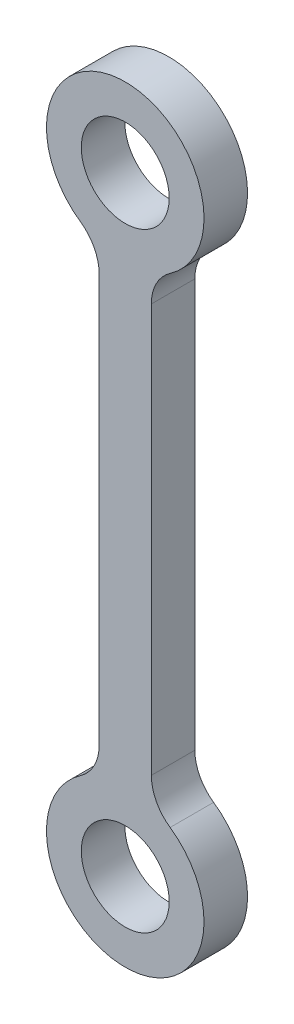
ISO-10303-21;
HEADER;
FILE_DESCRIPTION(('STEP AP214'),'2;1');
FILE_NAME('part.step','',(''),(''),'','','');
FILE_SCHEMA(('AUTOMOTIVE_DESIGN { 1 0 10303 214 1 1 1 1 }'));
ENDSEC;
DATA;
#1=APPLICATION_CONTEXT('core data for automotive mechanical design processes');
#2=APPLICATION_PROTOCOL_DEFINITION('international standard','automotive_design',2000,#1);
#3=PRODUCT_CONTEXT('',#1,'mechanical');
#4=PRODUCT('Part','Part','',(#3));
#5=PRODUCT_RELATED_PRODUCT_CATEGORY('part','',(#4));
#6=PRODUCT_DEFINITION_FORMATION('','',#4);
#7=PRODUCT_DEFINITION_CONTEXT('part definition',#1,'design');
#8=PRODUCT_DEFINITION('design','',#6,#7);
#9=PRODUCT_DEFINITION_SHAPE('','',#8);
#10=(LENGTH_UNIT() NAMED_UNIT(*) SI_UNIT(.MILLI.,.METRE.));
#11=(NAMED_UNIT(*) PLANE_ANGLE_UNIT() SI_UNIT($,.RADIAN.));
#12=(NAMED_UNIT(*) SI_UNIT($,.STERADIAN.) SOLID_ANGLE_UNIT());
#13=UNCERTAINTY_MEASURE_WITH_UNIT(LENGTH_MEASURE(1.E-05),#10,'distance_accuracy_value','');
#14=(GEOMETRIC_REPRESENTATION_CONTEXT(3) GLOBAL_UNCERTAINTY_ASSIGNED_CONTEXT((#13)) GLOBAL_UNIT_ASSIGNED_CONTEXT((#10,
#11,#12)) REPRESENTATION_CONTEXT('',''));
#15=CARTESIAN_POINT('',(0.,0.,0.));
#16=DIRECTION('',(0.,0.,1.));
#17=DIRECTION('',(1.,0.,0.));
#18=AXIS2_PLACEMENT_3D('',#15,#16,#17);
#19=CARTESIAN_POINT('',(10.16,-74.2315,6.35));
#20=DIRECTION('',(0.,0.,1.));
#21=DIRECTION('',(1.,0.,0.));
#22=AXIS2_PLACEMENT_3D('',#19,#20,#21);
#23=PLANE('',#22);
#24=CARTESIAN_POINT('',(0.,0.,6.35));
#25=DIRECTION('',(0.,0.,1.));
#26=DIRECTION('',(1.,0.,0.));
#27=AXIS2_PLACEMENT_3D('',#24,#25,#26);
#28=CIRCLE('',#27,6.4135);
#29=CARTESIAN_POINT('',(6.4135,0.,6.35));
#30=VERTEX_POINT('',#29);
#31=EDGE_CURVE('E150',#30,#30,#28,.T.);
#32=ORIENTED_EDGE('',*,*,#31,.F.);
#33=EDGE_LOOP('',(#32));
#34=FACE_BOUND('',#33,.T.);
#35=CARTESIAN_POINT('',(10.16,-74.2315,6.35));
#36=DIRECTION('',(0.,0.,-1.));
#37=DIRECTION('',(1.,0.,0.));
#38=AXIS2_PLACEMENT_3D('',#35,#36,#37);
#39=CIRCLE('',#38,6.35);
#40=CARTESIAN_POINT('',(6.54434163701069,-79.4516067615658,6.35));
#41=VERTEX_POINT('',#40);
#42=CARTESIAN_POINT('',(3.81000000000001,-74.2315,6.35));
#43=VERTEX_POINT('',#42);
#44=EDGE_CURVE('E168',#41,#43,#39,.T.);
#45=ORIENTED_EDGE('',*,*,#44,.T.);
#46=DIRECTION('',(0.,1.,0.));
#47=VECTOR('',#46,1.);
#48=CARTESIAN_POINT('',(3.81,-14.6685,6.35));
#49=LINE('',#48,#47);
#50=CARTESIAN_POINT('',(3.81,-14.6685,6.35));
#51=VERTEX_POINT('',#50);
#52=EDGE_CURVE('E104',#43,#51,#49,.T.);
#53=ORIENTED_EDGE('',*,*,#52,.T.);
#54=CARTESIAN_POINT('',(10.16,-14.6685,6.35));
#55=DIRECTION('',(0.,0.,-1.));
#56=DIRECTION('',(-1.,0.,0.));
#57=AXIS2_PLACEMENT_3D('',#54,#55,#56);
#58=CIRCLE('',#57,6.35);
#59=CARTESIAN_POINT('',(6.54434163701068,-9.44839323843416,6.35));
#60=VERTEX_POINT('',#59);
#61=EDGE_CURVE('E189',#51,#60,#58,.T.);
#62=ORIENTED_EDGE('',*,*,#61,.T.);
#63=CARTESIAN_POINT('',(0.,0.,6.35));
#64=DIRECTION('',(0.,0.,1.));
#65=DIRECTION('',(1.,0.,0.));
#66=AXIS2_PLACEMENT_3D('',#63,#64,#65);
#67=CIRCLE('',#66,11.4935);
#68=CARTESIAN_POINT('',(-6.54434163701068,-9.44839323843416,6.35));
#69=VERTEX_POINT('',#68);
#70=EDGE_CURVE('E203',#60,#69,#67,.T.);
#71=ORIENTED_EDGE('',*,*,#70,.T.);
#72=CARTESIAN_POINT('',(-10.16,-14.6685,6.35));
#73=DIRECTION('',(0.,0.,-1.));
#74=DIRECTION('',(1.,0.,0.));
#75=AXIS2_PLACEMENT_3D('',#72,#73,#74);
#76=CIRCLE('',#75,6.35);
#77=CARTESIAN_POINT('',(-3.81,-14.6685,6.35));
#78=VERTEX_POINT('',#77);
#79=EDGE_CURVE('E123',#69,#78,#76,.T.);
#80=ORIENTED_EDGE('',*,*,#79,.T.);
#81=DIRECTION('',(0.,-1.,0.));
#82=VECTOR('',#81,1.);
#83=CARTESIAN_POINT('',(-3.81,-14.6685,6.35));
#84=LINE('',#83,#82);
#85=CARTESIAN_POINT('',(-3.80999999999999,-74.2315,6.35));
#86=VERTEX_POINT('',#85);
#87=EDGE_CURVE('E117',#78,#86,#84,.T.);
#88=ORIENTED_EDGE('',*,*,#87,.T.);
#89=CARTESIAN_POINT('',(-10.16,-74.2315,6.35));
#90=DIRECTION('',(0.,0.,-1.));
#91=DIRECTION('',(-1.,0.,0.));
#92=AXIS2_PLACEMENT_3D('',#89,#90,#91);
#93=CIRCLE('',#92,6.35);
#94=CARTESIAN_POINT('',(-6.54434163701067,-79.4516067615658,6.35));
#95=VERTEX_POINT('',#94);
#96=EDGE_CURVE('E121',#86,#95,#93,.T.);
#97=ORIENTED_EDGE('',*,*,#96,.T.);
#98=CARTESIAN_POINT('',(0.,-88.9,6.35));
#99=DIRECTION('',(0.,0.,1.));
#100=DIRECTION('',(1.,0.,0.));
#101=AXIS2_PLACEMENT_3D('',#98,#99,#100);
#102=CIRCLE('',#101,11.4935);
#103=EDGE_CURVE('E61',#95,#41,#102,.T.);
#104=ORIENTED_EDGE('',*,*,#103,.T.);
#105=EDGE_LOOP('',(#45,#53,#62,#71,#80,#88,#97,#104));
#106=FACE_BOUND('',#105,.T.);
#107=CARTESIAN_POINT('',(0.,-88.9,6.35));
#108=DIRECTION('',(0.,0.,1.));
#109=DIRECTION('',(1.,0.,0.));
#110=AXIS2_PLACEMENT_3D('',#107,#108,#109);
#111=CIRCLE('',#110,6.4135);
#112=CARTESIAN_POINT('',(6.41350000000001,-88.9,6.35));
#113=VERTEX_POINT('',#112);
#114=EDGE_CURVE('E217',#113,#113,#111,.T.);
#115=ORIENTED_EDGE('',*,*,#114,.F.);
#116=EDGE_LOOP('',(#115));
#117=FACE_BOUND('',#116,.T.);
#118=ADVANCED_FACE('F43',(#34,#106,#117),#23,.T.);
#119=CARTESIAN_POINT('',(10.16,-74.2315,0.));
#120=DIRECTION('',(0.,0.,1.));
#121=DIRECTION('',(1.,0.,0.));
#122=AXIS2_PLACEMENT_3D('',#119,#120,#121);
#123=PLANE('',#122);
#124=CARTESIAN_POINT('',(10.16,-74.2315,0.));
#125=DIRECTION('',(0.,0.,-1.));
#126=DIRECTION('',(1.,0.,0.));
#127=AXIS2_PLACEMENT_3D('',#124,#125,#126);
#128=CIRCLE('',#127,6.35);
#129=CARTESIAN_POINT('',(6.54434163701069,-79.4516067615658,0.));
#130=VERTEX_POINT('',#129);
#131=CARTESIAN_POINT('',(3.81000000000001,-74.2315,0.));
#132=VERTEX_POINT('',#131);
#133=EDGE_CURVE('E145',#130,#132,#128,.T.);
#134=ORIENTED_EDGE('',*,*,#133,.F.);
#135=CARTESIAN_POINT('',(0.,-88.9,0.));
#136=DIRECTION('',(0.,0.,1.));
#137=DIRECTION('',(1.,0.,0.));
#138=AXIS2_PLACEMENT_3D('',#135,#136,#137);
#139=CIRCLE('',#138,11.4935);
#140=CARTESIAN_POINT('',(-6.54434163701067,-79.4516067615658,0.));
#141=VERTEX_POINT('',#140);
#142=EDGE_CURVE('E96',#141,#130,#139,.T.);
#143=ORIENTED_EDGE('',*,*,#142,.F.);
#144=CARTESIAN_POINT('',(-10.16,-74.2315,0.));
#145=DIRECTION('',(0.,0.,-1.));
#146=DIRECTION('',(-1.,0.,0.));
#147=AXIS2_PLACEMENT_3D('',#144,#145,#146);
#148=CIRCLE('',#147,6.35);
#149=CARTESIAN_POINT('',(-3.80999999999999,-74.2315,0.));
#150=VERTEX_POINT('',#149);
#151=EDGE_CURVE('E90',#150,#141,#148,.T.);
#152=ORIENTED_EDGE('',*,*,#151,.F.);
#153=DIRECTION('',(0.,-1.,0.));
#154=VECTOR('',#153,1.);
#155=CARTESIAN_POINT('',(-3.81,-14.6685,0.));
#156=LINE('',#155,#154);
#157=CARTESIAN_POINT('',(-3.81,-14.6685,0.));
#158=VERTEX_POINT('',#157);
#159=EDGE_CURVE('E132',#158,#150,#156,.T.);
#160=ORIENTED_EDGE('',*,*,#159,.F.);
#161=CARTESIAN_POINT('',(-10.16,-14.6685,0.));
#162=DIRECTION('',(0.,0.,-1.));
#163=DIRECTION('',(1.,0.,0.));
#164=AXIS2_PLACEMENT_3D('',#161,#162,#163);
#165=CIRCLE('',#164,6.35);
#166=CARTESIAN_POINT('',(-6.54434163701068,-9.44839323843416,0.));
#167=VERTEX_POINT('',#166);
#168=EDGE_CURVE('E159',#167,#158,#165,.T.);
#169=ORIENTED_EDGE('',*,*,#168,.F.);
#170=CARTESIAN_POINT('',(0.,0.,0.));
#171=DIRECTION('',(0.,0.,1.));
#172=DIRECTION('',(1.,0.,0.));
#173=AXIS2_PLACEMENT_3D('',#170,#171,#172);
#174=CIRCLE('',#173,11.4935);
#175=CARTESIAN_POINT('',(6.54434163701068,-9.44839323843416,0.));
#176=VERTEX_POINT('',#175);
#177=EDGE_CURVE('E156',#176,#167,#174,.T.);
#178=ORIENTED_EDGE('',*,*,#177,.F.);
#179=CARTESIAN_POINT('',(10.16,-14.6685,0.));
#180=DIRECTION('',(0.,0.,-1.));
#181=DIRECTION('',(-1.,0.,0.));
#182=AXIS2_PLACEMENT_3D('',#179,#180,#181);
#183=CIRCLE('',#182,6.35);
#184=CARTESIAN_POINT('',(3.81,-14.6685,0.));
#185=VERTEX_POINT('',#184);
#186=EDGE_CURVE('E153',#185,#176,#183,.T.);
#187=ORIENTED_EDGE('',*,*,#186,.F.);
#188=DIRECTION('',(0.,1.,0.));
#189=VECTOR('',#188,1.);
#190=CARTESIAN_POINT('',(3.81,-14.6685,0.));
#191=LINE('',#190,#189);
#192=EDGE_CURVE('E149',#132,#185,#191,.T.);
#193=ORIENTED_EDGE('',*,*,#192,.F.);
#194=EDGE_LOOP('',(#134,#143,#152,#160,#169,#178,#187,#193));
#195=FACE_BOUND('',#194,.T.);
#196=CARTESIAN_POINT('',(0.,0.,0.));
#197=DIRECTION('',(0.,0.,1.));
#198=DIRECTION('',(1.,0.,0.));
#199=AXIS2_PLACEMENT_3D('',#196,#197,#198);
#200=CIRCLE('',#199,6.4135);
#201=CARTESIAN_POINT('',(6.4135,0.,0.));
#202=VERTEX_POINT('',#201);
#203=EDGE_CURVE('E213',#202,#202,#200,.T.);
#204=ORIENTED_EDGE('',*,*,#203,.T.);
#205=EDGE_LOOP('',(#204));
#206=FACE_BOUND('',#205,.T.);
#207=CARTESIAN_POINT('',(0.,-88.9,0.));
#208=DIRECTION('',(0.,0.,1.));
#209=DIRECTION('',(1.,0.,0.));
#210=AXIS2_PLACEMENT_3D('',#207,#208,#209);
#211=CIRCLE('',#210,6.4135);
#212=CARTESIAN_POINT('',(6.41350000000001,-88.9,0.));
#213=VERTEX_POINT('',#212);
#214=EDGE_CURVE('E221',#213,#213,#211,.T.);
#215=ORIENTED_EDGE('',*,*,#214,.T.);
#216=EDGE_LOOP('',(#215));
#217=FACE_BOUND('',#216,.T.);
#218=ADVANCED_FACE('F193',(#195,#206,#217),#123,.F.);
#219=CARTESIAN_POINT('',(10.16,-74.2315,6.35));
#220=DIRECTION('',(0.,0.,-1.));
#221=DIRECTION('',(-1.,0.,0.));
#222=AXIS2_PLACEMENT_3D('',#219,#220,#221);
#223=CYLINDRICAL_SURFACE('',#222,6.35);
#224=ORIENTED_EDGE('',*,*,#133,.T.);
#225=DIRECTION('',(0.,0.,-1.));
#226=VECTOR('',#225,1.);
#227=CARTESIAN_POINT('',(3.81000000000001,-74.2315,6.35));
#228=LINE('',#227,#226);
#229=EDGE_CURVE('E11',#43,#132,#228,.T.);
#230=ORIENTED_EDGE('',*,*,#229,.F.);
#231=ORIENTED_EDGE('',*,*,#44,.F.);
#232=DIRECTION('',(0.,0.,-1.));
#233=VECTOR('',#232,1.);
#234=CARTESIAN_POINT('',(6.54434163701069,-79.4516067615658,6.35));
#235=LINE('',#234,#233);
#236=EDGE_CURVE('E141',#41,#130,#235,.T.);
#237=ORIENTED_EDGE('',*,*,#236,.T.);
#238=EDGE_LOOP('',(#224,#230,#231,#237));
#239=FACE_BOUND('',#238,.T.);
#240=ADVANCED_FACE('F45',(#239),#223,.F.);
#241=CARTESIAN_POINT('',(3.81,-14.6685,6.35));
#242=DIRECTION('',(-1.,0.,0.));
#243=DIRECTION('',(0.,-1.,0.));
#244=AXIS2_PLACEMENT_3D('',#241,#242,#243);
#245=PLANE('',#244);
#246=ORIENTED_EDGE('',*,*,#192,.T.);
#247=DIRECTION('',(0.,0.,-1.));
#248=VECTOR('',#247,1.);
#249=CARTESIAN_POINT('',(3.81,-14.6685,6.35));
#250=LINE('',#249,#248);
#251=EDGE_CURVE('E53',#51,#185,#250,.T.);
#252=ORIENTED_EDGE('',*,*,#251,.F.);
#253=ORIENTED_EDGE('',*,*,#52,.F.);
#254=ORIENTED_EDGE('',*,*,#229,.T.);
#255=EDGE_LOOP('',(#246,#252,#253,#254));
#256=FACE_BOUND('',#255,.T.);
#257=ADVANCED_FACE('F255',(#256),#245,.F.);
#258=CARTESIAN_POINT('',(10.16,-14.6685,6.35));
#259=DIRECTION('',(0.,0.,-1.));
#260=DIRECTION('',(-1.,0.,0.));
#261=AXIS2_PLACEMENT_3D('',#258,#259,#260);
#262=CYLINDRICAL_SURFACE('',#261,6.35);
#263=ORIENTED_EDGE('',*,*,#186,.T.);
#264=DIRECTION('',(0.,0.,-1.));
#265=VECTOR('',#264,1.);
#266=CARTESIAN_POINT('',(6.54434163701068,-9.44839323843416,6.35));
#267=LINE('',#266,#265);
#268=EDGE_CURVE('E179',#60,#176,#267,.T.);
#269=ORIENTED_EDGE('',*,*,#268,.F.);
#270=ORIENTED_EDGE('',*,*,#61,.F.);
#271=ORIENTED_EDGE('',*,*,#251,.T.);
#272=EDGE_LOOP('',(#263,#269,#270,#271));
#273=FACE_BOUND('',#272,.T.);
#274=ADVANCED_FACE('F187',(#273),#262,.F.);
#275=CARTESIAN_POINT('',(0.,0.,6.35));
#276=DIRECTION('',(0.,0.,-1.));
#277=DIRECTION('',(-1.,0.,0.));
#278=AXIS2_PLACEMENT_3D('',#275,#276,#277);
#279=CYLINDRICAL_SURFACE('',#278,11.4935);
#280=ORIENTED_EDGE('',*,*,#177,.T.);
#281=DIRECTION('',(0.,0.,-1.));
#282=VECTOR('',#281,1.);
#283=CARTESIAN_POINT('',(-6.54434163701068,-9.44839323843416,6.35));
#284=LINE('',#283,#282);
#285=EDGE_CURVE('E175',#69,#167,#284,.T.);
#286=ORIENTED_EDGE('',*,*,#285,.F.);
#287=ORIENTED_EDGE('',*,*,#70,.F.);
#288=ORIENTED_EDGE('',*,*,#268,.T.);
#289=EDGE_LOOP('',(#280,#286,#287,#288));
#290=FACE_BOUND('',#289,.T.);
#291=ADVANCED_FACE('F198',(#290),#279,.T.);
#292=CARTESIAN_POINT('',(-10.16,-14.6685,6.35));
#293=DIRECTION('',(0.,0.,-1.));
#294=DIRECTION('',(-1.,0.,0.));
#295=AXIS2_PLACEMENT_3D('',#292,#293,#294);
#296=CYLINDRICAL_SURFACE('',#295,6.35);
#297=ORIENTED_EDGE('',*,*,#168,.T.);
#298=DIRECTION('',(0.,0.,-1.));
#299=VECTOR('',#298,1.);
#300=CARTESIAN_POINT('',(-3.81,-14.6685,6.35));
#301=LINE('',#300,#299);
#302=EDGE_CURVE('E134',#78,#158,#301,.T.);
#303=ORIENTED_EDGE('',*,*,#302,.F.);
#304=ORIENTED_EDGE('',*,*,#79,.F.);
#305=ORIENTED_EDGE('',*,*,#285,.T.);
#306=EDGE_LOOP('',(#297,#303,#304,#305));
#307=FACE_BOUND('',#306,.T.);
#308=ADVANCED_FACE('F201',(#307),#296,.F.);
#309=CARTESIAN_POINT('',(-3.81,-14.6685,6.35));
#310=DIRECTION('',(1.,0.,0.));
#311=DIRECTION('',(0.,1.,0.));
#312=AXIS2_PLACEMENT_3D('',#309,#310,#311);
#313=PLANE('',#312);
#314=ORIENTED_EDGE('',*,*,#159,.T.);
#315=DIRECTION('',(0.,0.,-1.));
#316=VECTOR('',#315,1.);
#317=CARTESIAN_POINT('',(-3.80999999999999,-74.2315,6.35));
#318=LINE('',#317,#316);
#319=EDGE_CURVE('E129',#86,#150,#318,.T.);
#320=ORIENTED_EDGE('',*,*,#319,.F.);
#321=ORIENTED_EDGE('',*,*,#87,.F.);
#322=ORIENTED_EDGE('',*,*,#302,.T.);
#323=EDGE_LOOP('',(#314,#320,#321,#322));
#324=FACE_BOUND('',#323,.T.);
#325=ADVANCED_FACE('F130',(#324),#313,.F.);
#326=CARTESIAN_POINT('',(-10.16,-74.2315,6.35));
#327=DIRECTION('',(0.,0.,-1.));
#328=DIRECTION('',(-1.,0.,0.));
#329=AXIS2_PLACEMENT_3D('',#326,#327,#328);
#330=CYLINDRICAL_SURFACE('',#329,6.35);
#331=ORIENTED_EDGE('',*,*,#151,.T.);
#332=DIRECTION('',(0.,0.,-1.));
#333=VECTOR('',#332,1.);
#334=CARTESIAN_POINT('',(-6.54434163701067,-79.4516067615658,6.35));
#335=LINE('',#334,#333);
#336=EDGE_CURVE('E135',#95,#141,#335,.T.);
#337=ORIENTED_EDGE('',*,*,#336,.F.);
#338=ORIENTED_EDGE('',*,*,#96,.F.);
#339=ORIENTED_EDGE('',*,*,#319,.T.);
#340=EDGE_LOOP('',(#331,#337,#338,#339));
#341=FACE_BOUND('',#340,.T.);
#342=ADVANCED_FACE('F137',(#341),#330,.F.);
#343=CARTESIAN_POINT('',(0.,-88.9,6.35));
#344=DIRECTION('',(0.,0.,-1.));
#345=DIRECTION('',(-1.,0.,0.));
#346=AXIS2_PLACEMENT_3D('',#343,#344,#345);
#347=CYLINDRICAL_SURFACE('',#346,11.4935);
#348=ORIENTED_EDGE('',*,*,#142,.T.);
#349=ORIENTED_EDGE('',*,*,#236,.F.);
#350=ORIENTED_EDGE('',*,*,#103,.F.);
#351=ORIENTED_EDGE('',*,*,#336,.T.);
#352=EDGE_LOOP('',(#348,#349,#350,#351));
#353=FACE_BOUND('',#352,.T.);
#354=ADVANCED_FACE('F243',(#353),#347,.T.);
#355=CARTESIAN_POINT('',(0.,0.,6.35));
#356=DIRECTION('',(0.,0.,-1.));
#357=DIRECTION('',(-1.,0.,0.));
#358=AXIS2_PLACEMENT_3D('',#355,#356,#357);
#359=CYLINDRICAL_SURFACE('',#358,6.4135);
#360=ORIENTED_EDGE('',*,*,#31,.T.);
#361=EDGE_LOOP('',(#360));
#362=FACE_BOUND('',#361,.T.);
#363=ORIENTED_EDGE('',*,*,#203,.F.);
#364=EDGE_LOOP('',(#363));
#365=FACE_BOUND('',#364,.T.);
#366=ADVANCED_FACE('F240',(#362,#365),#359,.F.);
#367=CARTESIAN_POINT('',(0.,-88.9,6.35));
#368=DIRECTION('',(0.,0.,-1.));
#369=DIRECTION('',(-1.,0.,0.));
#370=AXIS2_PLACEMENT_3D('',#367,#368,#369);
#371=CYLINDRICAL_SURFACE('',#370,6.4135);
#372=ORIENTED_EDGE('',*,*,#114,.T.);
#373=EDGE_LOOP('',(#372));
#374=FACE_BOUND('',#373,.T.);
#375=ORIENTED_EDGE('',*,*,#214,.F.);
#376=EDGE_LOOP('',(#375));
#377=FACE_BOUND('',#376,.T.);
#378=ADVANCED_FACE('F229',(#374,#377),#371,.F.);
#379=CLOSED_SHELL('',(#118,#218,#240,#257,#274,#291,#308,#325,#342,#354,#366,#378));
#380=MANIFOLD_SOLID_BREP('B2',#379);
#381=ADVANCED_BREP_SHAPE_REPRESENTATION('',(#18,#380),#14);
#382=SHAPE_DEFINITION_REPRESENTATION(#9,#381);
ENDSEC;
END-ISO-10303-21;
